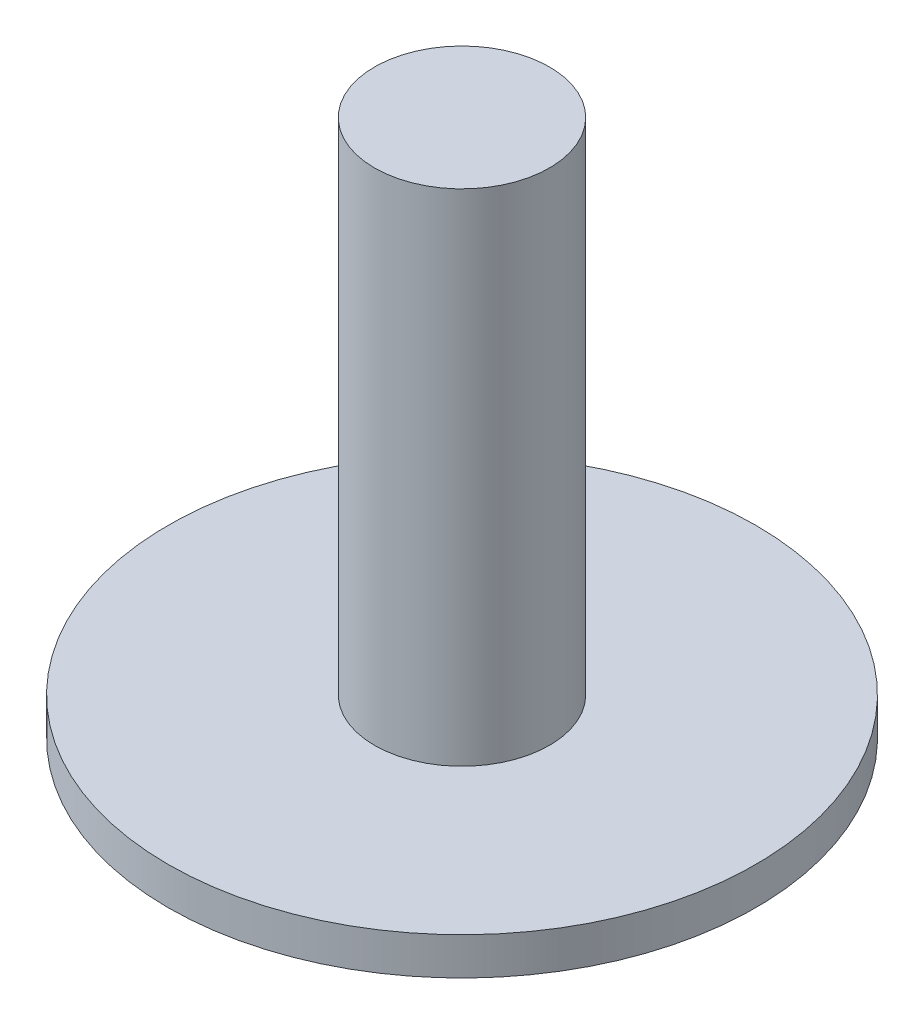
ISO-10303-21;
HEADER;
FILE_DESCRIPTION(('STEP AP214'),'2;1');
FILE_NAME('part.step','',(''),(''),'','','');
FILE_SCHEMA(('AUTOMOTIVE_DESIGN { 1 0 10303 214 1 1 1 1 }'));
ENDSEC;
DATA;
#1=APPLICATION_CONTEXT('core data for automotive mechanical design processes');
#2=APPLICATION_PROTOCOL_DEFINITION('international standard','automotive_design',2000,#1);
#3=PRODUCT_CONTEXT('',#1,'mechanical');
#4=PRODUCT('Part','Part','',(#3));
#5=PRODUCT_RELATED_PRODUCT_CATEGORY('part','',(#4));
#6=PRODUCT_DEFINITION_FORMATION('','',#4);
#7=PRODUCT_DEFINITION_CONTEXT('part definition',#1,'design');
#8=PRODUCT_DEFINITION('design','',#6,#7);
#9=PRODUCT_DEFINITION_SHAPE('','',#8);
#10=(LENGTH_UNIT() NAMED_UNIT(*) SI_UNIT(.MILLI.,.METRE.));
#11=(NAMED_UNIT(*) PLANE_ANGLE_UNIT() SI_UNIT($,.RADIAN.));
#12=(NAMED_UNIT(*) SI_UNIT($,.STERADIAN.) SOLID_ANGLE_UNIT());
#13=UNCERTAINTY_MEASURE_WITH_UNIT(LENGTH_MEASURE(1.E-05),#10,'distance_accuracy_value','');
#14=(GEOMETRIC_REPRESENTATION_CONTEXT(3) GLOBAL_UNCERTAINTY_ASSIGNED_CONTEXT((#13)) GLOBAL_UNIT_ASSIGNED_CONTEXT((#10,
#11,#12)) REPRESENTATION_CONTEXT('',''));
#15=CARTESIAN_POINT('',(0.,0.,0.));
#16=DIRECTION('',(0.,0.,1.));
#17=DIRECTION('',(1.,0.,0.));
#18=AXIS2_PLACEMENT_3D('',#15,#16,#17);
#19=CARTESIAN_POINT('',(0.,1.5,0.));
#20=DIRECTION('',(0.,-1.,0.));
#21=DIRECTION('',(0.,0.,-1.));
#22=AXIS2_PLACEMENT_3D('',#19,#20,#21);
#23=CYLINDRICAL_SURFACE('',#22,11.75);
#24=CARTESIAN_POINT('',(0.,1.5,0.));
#25=DIRECTION('',(0.,1.,0.));
#26=DIRECTION('',(0.,0.,1.));
#27=AXIS2_PLACEMENT_3D('',#24,#25,#26);
#28=CIRCLE('',#27,11.75);
#29=CARTESIAN_POINT('',(0.,1.5,11.75));
#30=VERTEX_POINT('',#29);
#31=EDGE_CURVE('E10',#30,#30,#28,.T.);
#32=ORIENTED_EDGE('',*,*,#31,.F.);
#33=EDGE_LOOP('',(#32));
#34=FACE_BOUND('',#33,.T.);
#35=CARTESIAN_POINT('',(0.,0.,0.));
#36=DIRECTION('',(0.,1.,0.));
#37=DIRECTION('',(0.,0.,1.));
#38=AXIS2_PLACEMENT_3D('',#35,#36,#37);
#39=CIRCLE('',#38,11.75);
#40=CARTESIAN_POINT('',(0.,0.,11.75));
#41=VERTEX_POINT('',#40);
#42=EDGE_CURVE('E34',#41,#41,#39,.T.);
#43=ORIENTED_EDGE('',*,*,#42,.T.);
#44=EDGE_LOOP('',(#43));
#45=FACE_BOUND('',#44,.T.);
#46=ADVANCED_FACE('F31',(#34,#45),#23,.T.);
#47=CARTESIAN_POINT('',(0.,1.5,0.));
#48=DIRECTION('',(0.,1.,0.));
#49=DIRECTION('',(0.,0.,1.));
#50=AXIS2_PLACEMENT_3D('',#47,#48,#49);
#51=PLANE('',#50);
#52=CARTESIAN_POINT('',(0.,1.5,0.));
#53=DIRECTION('',(0.,1.,0.));
#54=DIRECTION('',(0.,0.,1.));
#55=AXIS2_PLACEMENT_3D('',#52,#53,#54);
#56=CIRCLE('',#55,3.5);
#57=CARTESIAN_POINT('',(0.,1.5,3.5));
#58=VERTEX_POINT('',#57);
#59=EDGE_CURVE('E43',#58,#58,#56,.T.);
#60=ORIENTED_EDGE('',*,*,#59,.F.);
#61=EDGE_LOOP('',(#60));
#62=FACE_BOUND('',#61,.T.);
#63=ORIENTED_EDGE('',*,*,#31,.T.);
#64=EDGE_LOOP('',(#63));
#65=FACE_BOUND('',#64,.T.);
#66=ADVANCED_FACE('F58',(#62,#65),#51,.T.);
#67=CARTESIAN_POINT('',(0.,0.,0.));
#68=DIRECTION('',(0.,1.,0.));
#69=DIRECTION('',(0.,0.,1.));
#70=AXIS2_PLACEMENT_3D('',#67,#68,#69);
#71=PLANE('',#70);
#72=ORIENTED_EDGE('',*,*,#42,.F.);
#73=EDGE_LOOP('',(#72));
#74=FACE_BOUND('',#73,.T.);
#75=ADVANCED_FACE('F54',(#74),#71,.F.);
#76=CARTESIAN_POINT('',(0.,21.5,0.));
#77=DIRECTION('',(0.,-1.,0.));
#78=DIRECTION('',(0.,0.,-1.));
#79=AXIS2_PLACEMENT_3D('',#76,#77,#78);
#80=CYLINDRICAL_SURFACE('',#79,3.5);
#81=CARTESIAN_POINT('',(0.,21.5,0.));
#82=DIRECTION('',(0.,1.,0.));
#83=DIRECTION('',(0.,0.,1.));
#84=AXIS2_PLACEMENT_3D('',#81,#82,#83);
#85=CIRCLE('',#84,3.5);
#86=CARTESIAN_POINT('',(0.,21.5,3.5));
#87=VERTEX_POINT('',#86);
#88=EDGE_CURVE('E41',#87,#87,#85,.T.);
#89=ORIENTED_EDGE('',*,*,#88,.F.);
#90=EDGE_LOOP('',(#89));
#91=FACE_BOUND('',#90,.T.);
#92=ORIENTED_EDGE('',*,*,#59,.T.);
#93=EDGE_LOOP('',(#92));
#94=FACE_BOUND('',#93,.T.);
#95=ADVANCED_FACE('F51',(#91,#94),#80,.T.);
#96=CARTESIAN_POINT('',(0.,21.5,0.));
#97=DIRECTION('',(0.,1.,0.));
#98=DIRECTION('',(0.,0.,1.));
#99=AXIS2_PLACEMENT_3D('',#96,#97,#98);
#100=PLANE('',#99);
#101=ORIENTED_EDGE('',*,*,#88,.T.);
#102=EDGE_LOOP('',(#101));
#103=FACE_BOUND('',#102,.T.);
#104=ADVANCED_FACE('F49',(#103),#100,.T.);
#105=CLOSED_SHELL('',(#46,#66,#75,#95,#104));
#106=MANIFOLD_SOLID_BREP('B2',#105);
#107=ADVANCED_BREP_SHAPE_REPRESENTATION('',(#18,#106),#14);
#108=SHAPE_DEFINITION_REPRESENTATION(#9,#107);
ENDSEC;
END-ISO-10303-21;
